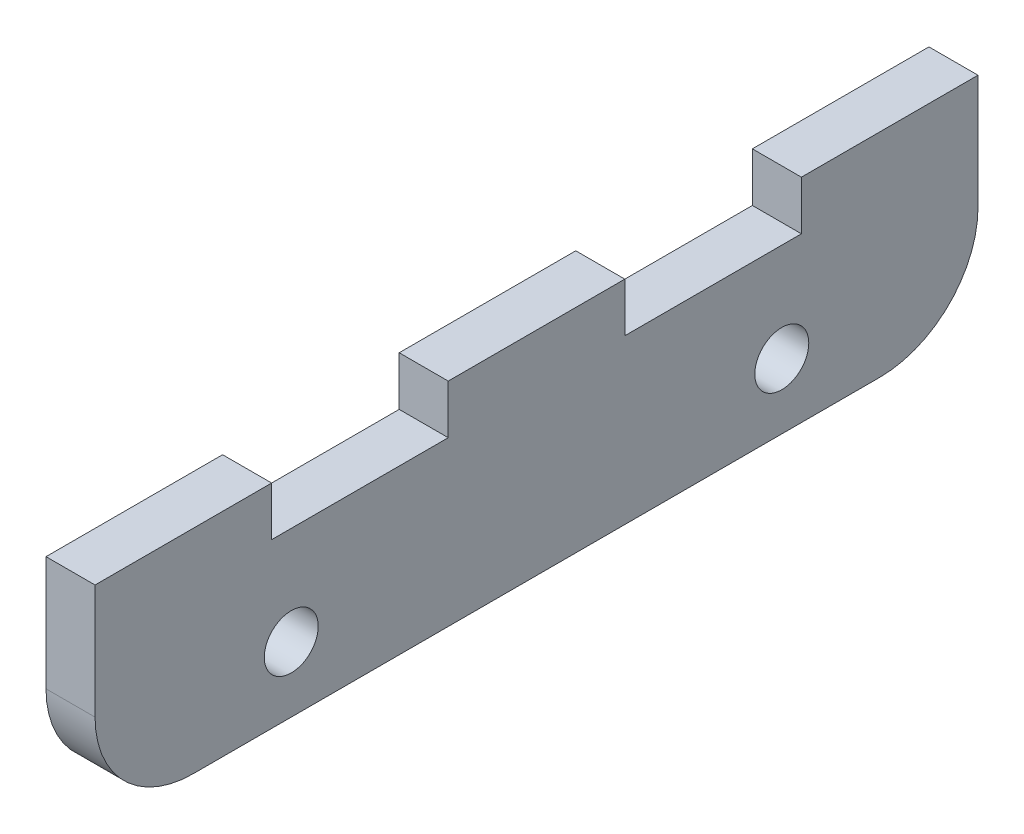
ISO-10303-21;
HEADER;
FILE_DESCRIPTION(('STEP AP214'),'2;1');
FILE_NAME('part.step','',(''),(''),'','','');
FILE_SCHEMA(('AUTOMOTIVE_DESIGN { 1 0 10303 214 1 1 1 1 }'));
ENDSEC;
DATA;
#1=APPLICATION_CONTEXT('core data for automotive mechanical design processes');
#2=APPLICATION_PROTOCOL_DEFINITION('international standard','automotive_design',2000,#1);
#3=PRODUCT_CONTEXT('',#1,'mechanical');
#4=PRODUCT('Part','Part','',(#3));
#5=PRODUCT_RELATED_PRODUCT_CATEGORY('part','',(#4));
#6=PRODUCT_DEFINITION_FORMATION('','',#4);
#7=PRODUCT_DEFINITION_CONTEXT('part definition',#1,'design');
#8=PRODUCT_DEFINITION('design','',#6,#7);
#9=PRODUCT_DEFINITION_SHAPE('','',#8);
#10=(LENGTH_UNIT() NAMED_UNIT(*) SI_UNIT(.MILLI.,.METRE.));
#11=(NAMED_UNIT(*) PLANE_ANGLE_UNIT() SI_UNIT($,.RADIAN.));
#12=(NAMED_UNIT(*) SI_UNIT($,.STERADIAN.) SOLID_ANGLE_UNIT());
#13=UNCERTAINTY_MEASURE_WITH_UNIT(LENGTH_MEASURE(1.E-05),#10,'distance_accuracy_value','');
#14=(GEOMETRIC_REPRESENTATION_CONTEXT(3) GLOBAL_UNCERTAINTY_ASSIGNED_CONTEXT((#13)) GLOBAL_UNIT_ASSIGNED_CONTEXT((#10,
#11,#12)) REPRESENTATION_CONTEXT('',''));
#15=CARTESIAN_POINT('',(0.,0.,0.));
#16=DIRECTION('',(0.,0.,1.));
#17=DIRECTION('',(1.,0.,0.));
#18=AXIS2_PLACEMENT_3D('',#15,#16,#17);
#19=CARTESIAN_POINT('',(3.,-0.499999999999992,-21.));
#20=DIRECTION('',(-1.,0.,0.));
#21=DIRECTION('',(0.,0.,1.));
#22=AXIS2_PLACEMENT_3D('',#19,#20,#21);
#23=PLANE('',#22);
#24=DIRECTION('',(0.,0.,1.));
#25=VECTOR('',#24,1.);
#26=CARTESIAN_POINT('',(3.,6.50000000000001,27.));
#27=LINE('',#26,#25);
#28=CARTESIAN_POINT('',(3.,6.50000000000001,16.2));
#29=VERTEX_POINT('',#28);
#30=CARTESIAN_POINT('',(3.,6.50000000000001,27.));
#31=VERTEX_POINT('',#30);
#32=EDGE_CURVE('E193',#29,#31,#27,.T.);
#33=ORIENTED_EDGE('',*,*,#32,.T.);
#34=DIRECTION('',(0.,-1.,0.));
#35=VECTOR('',#34,1.);
#36=CARTESIAN_POINT('',(3.,-0.499999999999947,27.));
#37=LINE('',#36,#35);
#38=CARTESIAN_POINT('',(3.,-0.499999999999947,27.));
#39=VERTEX_POINT('',#38);
#40=EDGE_CURVE('E111',#31,#39,#37,.T.);
#41=ORIENTED_EDGE('',*,*,#40,.T.);
#42=CARTESIAN_POINT('',(3.,-0.499999999999989,21.));
#43=DIRECTION('',(1.,0.,0.));
#44=DIRECTION('',(0.,0.,1.));
#45=AXIS2_PLACEMENT_3D('',#42,#43,#44);
#46=CIRCLE('',#45,6.);
#47=CARTESIAN_POINT('',(3.,-6.49999999999999,20.9999999999999));
#48=VERTEX_POINT('',#47);
#49=EDGE_CURVE('E226',#39,#48,#46,.T.);
#50=ORIENTED_EDGE('',*,*,#49,.T.);
#51=DIRECTION('',(0.,0.,-1.));
#52=VECTOR('',#51,1.);
#53=CARTESIAN_POINT('',(3.,-6.49999999999999,-21.));
#54=LINE('',#53,#52);
#55=CARTESIAN_POINT('',(3.,-6.49999999999999,-21.));
#56=VERTEX_POINT('',#55);
#57=EDGE_CURVE('E245',#48,#56,#54,.T.);
#58=ORIENTED_EDGE('',*,*,#57,.T.);
#59=CARTESIAN_POINT('',(3.,-0.499999999999992,-21.));
#60=DIRECTION('',(1.,0.,0.));
#61=DIRECTION('',(0.,0.,1.));
#62=AXIS2_PLACEMENT_3D('',#59,#60,#61);
#63=CIRCLE('',#62,6.);
#64=CARTESIAN_POINT('',(3.,-0.499999999999948,-27.));
#65=VERTEX_POINT('',#64);
#66=EDGE_CURVE('E242',#56,#65,#63,.T.);
#67=ORIENTED_EDGE('',*,*,#66,.T.);
#68=DIRECTION('',(0.,1.,0.));
#69=VECTOR('',#68,1.);
#70=CARTESIAN_POINT('',(3.,-0.499999999999949,-27.));
#71=LINE('',#70,#69);
#72=CARTESIAN_POINT('',(3.,6.50000000000001,-27.));
#73=VERTEX_POINT('',#72);
#74=EDGE_CURVE('E244',#65,#73,#71,.T.);
#75=ORIENTED_EDGE('',*,*,#74,.T.);
#76=DIRECTION('',(0.,0.,1.));
#77=VECTOR('',#76,1.);
#78=CARTESIAN_POINT('',(3.,6.50000000000001,-27.));
#79=LINE('',#78,#77);
#80=CARTESIAN_POINT('',(3.,6.50000000000002,-16.2));
#81=VERTEX_POINT('',#80);
#82=EDGE_CURVE('E247',#73,#81,#79,.T.);
#83=ORIENTED_EDGE('',*,*,#82,.T.);
#84=DIRECTION('',(0.,-1.,0.));
#85=VECTOR('',#84,1.);
#86=CARTESIAN_POINT('',(3.,6.50000000000002,-16.2));
#87=LINE('',#86,#85);
#88=CARTESIAN_POINT('',(3.,3.50000000000001,-16.2));
#89=VERTEX_POINT('',#88);
#90=EDGE_CURVE('E253',#81,#89,#87,.T.);
#91=ORIENTED_EDGE('',*,*,#90,.T.);
#92=DIRECTION('',(0.,0.,1.));
#93=VECTOR('',#92,1.);
#94=CARTESIAN_POINT('',(3.,3.50000000000001,-16.2));
#95=LINE('',#94,#93);
#96=CARTESIAN_POINT('',(3.,3.50000000000001,-5.40000000000001));
#97=VERTEX_POINT('',#96);
#98=EDGE_CURVE('E255',#89,#97,#95,.T.);
#99=ORIENTED_EDGE('',*,*,#98,.T.);
#100=DIRECTION('',(0.,1.,0.));
#101=VECTOR('',#100,1.);
#102=CARTESIAN_POINT('',(3.,3.50000000000001,-5.40000000000001));
#103=LINE('',#102,#101);
#104=CARTESIAN_POINT('',(3.,6.50000000000001,-5.40000000000001));
#105=VERTEX_POINT('',#104);
#106=EDGE_CURVE('E257',#97,#105,#103,.T.);
#107=ORIENTED_EDGE('',*,*,#106,.T.);
#108=DIRECTION('',(0.,0.,1.));
#109=VECTOR('',#108,1.);
#110=CARTESIAN_POINT('',(3.,6.50000000000001,-5.40000000000001));
#111=LINE('',#110,#109);
#112=CARTESIAN_POINT('',(3.,6.50000000000001,5.39999999999999));
#113=VERTEX_POINT('',#112);
#114=EDGE_CURVE('E148',#105,#113,#111,.T.);
#115=ORIENTED_EDGE('',*,*,#114,.T.);
#116=DIRECTION('',(0.,-1.,0.));
#117=VECTOR('',#116,1.);
#118=CARTESIAN_POINT('',(3.,3.50000000000001,5.39999999999999));
#119=LINE('',#118,#117);
#120=CARTESIAN_POINT('',(3.,3.50000000000001,5.39999999999999));
#121=VERTEX_POINT('',#120);
#122=EDGE_CURVE('E142',#113,#121,#119,.T.);
#123=ORIENTED_EDGE('',*,*,#122,.T.);
#124=DIRECTION('',(0.,0.,1.));
#125=VECTOR('',#124,1.);
#126=CARTESIAN_POINT('',(3.,3.50000000000001,5.39999999999999));
#127=LINE('',#126,#125);
#128=CARTESIAN_POINT('',(3.,3.50000000000001,16.2));
#129=VERTEX_POINT('',#128);
#130=EDGE_CURVE('E146',#121,#129,#127,.T.);
#131=ORIENTED_EDGE('',*,*,#130,.T.);
#132=DIRECTION('',(0.,1.,0.));
#133=VECTOR('',#132,1.);
#134=CARTESIAN_POINT('',(3.,3.50000000000001,16.2));
#135=LINE('',#134,#133);
#136=EDGE_CURVE('E50',#129,#29,#135,.T.);
#137=ORIENTED_EDGE('',*,*,#136,.T.);
#138=EDGE_LOOP('',(#33,#41,#50,#58,#67,#75,#83,#91,#99,#107,#115,#123,#131,#137));
#139=FACE_BOUND('',#138,.T.);
#140=CARTESIAN_POINT('',(3.,-2.50903230817688,15.));
#141=DIRECTION('',(1.,0.,0.));
#142=DIRECTION('',(0.,0.,-1.));
#143=AXIS2_PLACEMENT_3D('',#140,#141,#142);
#144=CIRCLE('',#143,1.65);
#145=CARTESIAN_POINT('',(3.,-2.50903230817688,13.35));
#146=VERTEX_POINT('',#145);
#147=EDGE_CURVE('E170',#146,#146,#144,.T.);
#148=ORIENTED_EDGE('',*,*,#147,.F.);
#149=EDGE_LOOP('',(#148));
#150=FACE_BOUND('',#149,.T.);
#151=CARTESIAN_POINT('',(3.,-2.50903230817688,-15.));
#152=DIRECTION('',(1.,0.,0.));
#153=DIRECTION('',(0.,0.,-1.));
#154=AXIS2_PLACEMENT_3D('',#151,#152,#153);
#155=CIRCLE('',#154,1.65);
#156=CARTESIAN_POINT('',(3.,-2.50903230817688,-16.65));
#157=VERTEX_POINT('',#156);
#158=EDGE_CURVE('E298',#157,#157,#155,.T.);
#159=ORIENTED_EDGE('',*,*,#158,.F.);
#160=EDGE_LOOP('',(#159));
#161=FACE_BOUND('',#160,.T.);
#162=ADVANCED_FACE('F33',(#139,#150,#161),#23,.F.);
#163=CARTESIAN_POINT('',(0.,-0.499999999999992,-21.));
#164=DIRECTION('',(-1.,0.,0.));
#165=DIRECTION('',(0.,0.,1.));
#166=AXIS2_PLACEMENT_3D('',#163,#164,#165);
#167=PLANE('',#166);
#168=CARTESIAN_POINT('',(0.,-2.50903230817688,15.));
#169=DIRECTION('',(1.,0.,0.));
#170=DIRECTION('',(0.,0.,-1.));
#171=AXIS2_PLACEMENT_3D('',#168,#169,#170);
#172=CIRCLE('',#171,1.65);
#173=CARTESIAN_POINT('',(0.,-2.50903230817688,13.35));
#174=VERTEX_POINT('',#173);
#175=EDGE_CURVE('E303',#174,#174,#172,.T.);
#176=ORIENTED_EDGE('',*,*,#175,.T.);
#177=EDGE_LOOP('',(#176));
#178=FACE_BOUND('',#177,.T.);
#179=DIRECTION('',(0.,0.,1.));
#180=VECTOR('',#179,1.);
#181=CARTESIAN_POINT('',(0.,6.50000000000001,27.));
#182=LINE('',#181,#180);
#183=CARTESIAN_POINT('',(0.,6.50000000000001,16.2));
#184=VERTEX_POINT('',#183);
#185=CARTESIAN_POINT('',(0.,6.50000000000001,27.));
#186=VERTEX_POINT('',#185);
#187=EDGE_CURVE('E166',#184,#186,#182,.T.);
#188=ORIENTED_EDGE('',*,*,#187,.F.);
#189=DIRECTION('',(0.,1.,0.));
#190=VECTOR('',#189,1.);
#191=CARTESIAN_POINT('',(0.,3.50000000000001,16.2));
#192=LINE('',#191,#190);
#193=CARTESIAN_POINT('',(0.,3.50000000000001,16.2));
#194=VERTEX_POINT('',#193);
#195=EDGE_CURVE('E103',#194,#184,#192,.T.);
#196=ORIENTED_EDGE('',*,*,#195,.F.);
#197=DIRECTION('',(0.,0.,1.));
#198=VECTOR('',#197,1.);
#199=CARTESIAN_POINT('',(0.,3.50000000000001,5.39999999999999));
#200=LINE('',#199,#198);
#201=CARTESIAN_POINT('',(0.,3.50000000000001,5.39999999999999));
#202=VERTEX_POINT('',#201);
#203=EDGE_CURVE('E97',#202,#194,#200,.T.);
#204=ORIENTED_EDGE('',*,*,#203,.F.);
#205=DIRECTION('',(0.,-1.,0.));
#206=VECTOR('',#205,1.);
#207=CARTESIAN_POINT('',(0.,3.50000000000001,5.39999999999999));
#208=LINE('',#207,#206);
#209=CARTESIAN_POINT('',(0.,6.50000000000001,5.39999999999999));
#210=VERTEX_POINT('',#209);
#211=EDGE_CURVE('E156',#210,#202,#208,.T.);
#212=ORIENTED_EDGE('',*,*,#211,.F.);
#213=DIRECTION('',(0.,0.,1.));
#214=VECTOR('',#213,1.);
#215=CARTESIAN_POINT('',(0.,6.50000000000001,-5.40000000000001));
#216=LINE('',#215,#214);
#217=CARTESIAN_POINT('',(0.,6.50000000000001,-5.40000000000001));
#218=VERTEX_POINT('',#217);
#219=EDGE_CURVE('E188',#218,#210,#216,.T.);
#220=ORIENTED_EDGE('',*,*,#219,.F.);
#221=DIRECTION('',(0.,1.,0.));
#222=VECTOR('',#221,1.);
#223=CARTESIAN_POINT('',(0.,3.50000000000001,-5.40000000000001));
#224=LINE('',#223,#222);
#225=CARTESIAN_POINT('',(0.,3.50000000000001,-5.40000000000001));
#226=VERTEX_POINT('',#225);
#227=EDGE_CURVE('E186',#226,#218,#224,.T.);
#228=ORIENTED_EDGE('',*,*,#227,.F.);
#229=DIRECTION('',(0.,0.,1.));
#230=VECTOR('',#229,1.);
#231=CARTESIAN_POINT('',(0.,3.50000000000001,-16.2));
#232=LINE('',#231,#230);
#233=CARTESIAN_POINT('',(0.,3.50000000000001,-16.2));
#234=VERTEX_POINT('',#233);
#235=EDGE_CURVE('E184',#234,#226,#232,.T.);
#236=ORIENTED_EDGE('',*,*,#235,.F.);
#237=DIRECTION('',(0.,-1.,0.));
#238=VECTOR('',#237,1.);
#239=CARTESIAN_POINT('',(0.,6.50000000000002,-16.2));
#240=LINE('',#239,#238);
#241=CARTESIAN_POINT('',(0.,6.50000000000002,-16.2));
#242=VERTEX_POINT('',#241);
#243=EDGE_CURVE('E182',#242,#234,#240,.T.);
#244=ORIENTED_EDGE('',*,*,#243,.F.);
#245=DIRECTION('',(0.,0.,1.));
#246=VECTOR('',#245,1.);
#247=CARTESIAN_POINT('',(0.,6.50000000000001,-27.));
#248=LINE('',#247,#246);
#249=CARTESIAN_POINT('',(0.,6.50000000000001,-27.));
#250=VERTEX_POINT('',#249);
#251=EDGE_CURVE('E180',#250,#242,#248,.T.);
#252=ORIENTED_EDGE('',*,*,#251,.F.);
#253=DIRECTION('',(0.,1.,0.));
#254=VECTOR('',#253,1.);
#255=CARTESIAN_POINT('',(0.,-0.499999999999949,-27.));
#256=LINE('',#255,#254);
#257=CARTESIAN_POINT('',(0.,-0.499999999999948,-27.));
#258=VERTEX_POINT('',#257);
#259=EDGE_CURVE('E178',#258,#250,#256,.T.);
#260=ORIENTED_EDGE('',*,*,#259,.F.);
#261=CARTESIAN_POINT('',(0.,-0.499999999999992,-21.));
#262=DIRECTION('',(1.,0.,0.));
#263=DIRECTION('',(0.,0.,1.));
#264=AXIS2_PLACEMENT_3D('',#261,#262,#263);
#265=CIRCLE('',#264,6.);
#266=CARTESIAN_POINT('',(0.,-6.49999999999999,-21.));
#267=VERTEX_POINT('',#266);
#268=EDGE_CURVE('E176',#267,#258,#265,.T.);
#269=ORIENTED_EDGE('',*,*,#268,.F.);
#270=DIRECTION('',(0.,0.,-1.));
#271=VECTOR('',#270,1.);
#272=CARTESIAN_POINT('',(0.,-6.49999999999999,-21.));
#273=LINE('',#272,#271);
#274=CARTESIAN_POINT('',(0.,-6.49999999999999,20.9999999999999));
#275=VERTEX_POINT('',#274);
#276=EDGE_CURVE('E174',#275,#267,#273,.T.);
#277=ORIENTED_EDGE('',*,*,#276,.F.);
#278=CARTESIAN_POINT('',(0.,-0.499999999999989,21.));
#279=DIRECTION('',(1.,0.,0.));
#280=DIRECTION('',(0.,0.,1.));
#281=AXIS2_PLACEMENT_3D('',#278,#279,#280);
#282=CIRCLE('',#281,6.);
#283=CARTESIAN_POINT('',(0.,-0.499999999999947,27.));
#284=VERTEX_POINT('',#283);
#285=EDGE_CURVE('E172',#284,#275,#282,.T.);
#286=ORIENTED_EDGE('',*,*,#285,.F.);
#287=DIRECTION('',(0.,-1.,0.));
#288=VECTOR('',#287,1.);
#289=CARTESIAN_POINT('',(0.,-0.499999999999947,27.));
#290=LINE('',#289,#288);
#291=EDGE_CURVE('E169',#186,#284,#290,.T.);
#292=ORIENTED_EDGE('',*,*,#291,.F.);
#293=EDGE_LOOP('',(#188,#196,#204,#212,#220,#228,#236,#244,#252,#260,#269,#277,#286,#292));
#294=FACE_BOUND('',#293,.T.);
#295=CARTESIAN_POINT('',(0.,-2.50903230817688,-15.));
#296=DIRECTION('',(1.,0.,0.));
#297=DIRECTION('',(0.,0.,-1.));
#298=AXIS2_PLACEMENT_3D('',#295,#296,#297);
#299=CIRCLE('',#298,1.65);
#300=CARTESIAN_POINT('',(0.,-2.50903230817688,-16.65));
#301=VERTEX_POINT('',#300);
#302=EDGE_CURVE('E301',#301,#301,#299,.T.);
#303=ORIENTED_EDGE('',*,*,#302,.T.);
#304=EDGE_LOOP('',(#303));
#305=FACE_BOUND('',#304,.T.);
#306=ADVANCED_FACE('F230',(#178,#294,#305),#167,.T.);
#307=CARTESIAN_POINT('',(3.,6.50000000000001,27.));
#308=DIRECTION('',(0.,-1.,0.));
#309=DIRECTION('',(0.,0.,-1.));
#310=AXIS2_PLACEMENT_3D('',#307,#308,#309);
#311=PLANE('',#310);
#312=ORIENTED_EDGE('',*,*,#187,.T.);
#313=DIRECTION('',(-1.,0.,0.));
#314=VECTOR('',#313,1.);
#315=CARTESIAN_POINT('',(3.,6.50000000000001,27.));
#316=LINE('',#315,#314);
#317=EDGE_CURVE('E11',#31,#186,#316,.T.);
#318=ORIENTED_EDGE('',*,*,#317,.F.);
#319=ORIENTED_EDGE('',*,*,#32,.F.);
#320=DIRECTION('',(-1.,0.,0.));
#321=VECTOR('',#320,1.);
#322=CARTESIAN_POINT('',(3.,6.50000000000001,16.2));
#323=LINE('',#322,#321);
#324=EDGE_CURVE('E162',#29,#184,#323,.T.);
#325=ORIENTED_EDGE('',*,*,#324,.T.);
#326=EDGE_LOOP('',(#312,#318,#319,#325));
#327=FACE_BOUND('',#326,.T.);
#328=ADVANCED_FACE('F35',(#327),#311,.F.);
#329=CARTESIAN_POINT('',(3.,-0.499999999999947,27.));
#330=DIRECTION('',(0.,0.,-1.));
#331=DIRECTION('',(-1.,0.,0.));
#332=AXIS2_PLACEMENT_3D('',#329,#330,#331);
#333=PLANE('',#332);
#334=ORIENTED_EDGE('',*,*,#291,.T.);
#335=DIRECTION('',(-1.,0.,0.));
#336=VECTOR('',#335,1.);
#337=CARTESIAN_POINT('',(3.,-0.499999999999947,27.));
#338=LINE('',#337,#336);
#339=EDGE_CURVE('E42',#39,#284,#338,.T.);
#340=ORIENTED_EDGE('',*,*,#339,.F.);
#341=ORIENTED_EDGE('',*,*,#40,.F.);
#342=ORIENTED_EDGE('',*,*,#317,.T.);
#343=EDGE_LOOP('',(#334,#340,#341,#342));
#344=FACE_BOUND('',#343,.T.);
#345=ADVANCED_FACE('F418',(#344),#333,.F.);
#346=CARTESIAN_POINT('',(3.,-0.499999999999989,21.));
#347=DIRECTION('',(-1.,0.,0.));
#348=DIRECTION('',(0.,0.,1.));
#349=AXIS2_PLACEMENT_3D('',#346,#347,#348);
#350=CYLINDRICAL_SURFACE('',#349,6.);
#351=ORIENTED_EDGE('',*,*,#285,.T.);
#352=DIRECTION('',(-1.,0.,0.));
#353=VECTOR('',#352,1.);
#354=CARTESIAN_POINT('',(3.,-6.49999999999999,20.9999999999999));
#355=LINE('',#354,#353);
#356=EDGE_CURVE('E218',#48,#275,#355,.T.);
#357=ORIENTED_EDGE('',*,*,#356,.F.);
#358=ORIENTED_EDGE('',*,*,#49,.F.);
#359=ORIENTED_EDGE('',*,*,#339,.T.);
#360=EDGE_LOOP('',(#351,#357,#358,#359));
#361=FACE_BOUND('',#360,.T.);
#362=ADVANCED_FACE('F224',(#361),#350,.T.);
#363=CARTESIAN_POINT('',(3.,-6.49999999999999,-21.));
#364=DIRECTION('',(0.,1.,0.));
#365=DIRECTION('',(0.,0.,1.));
#366=AXIS2_PLACEMENT_3D('',#363,#364,#365);
#367=PLANE('',#366);
#368=ORIENTED_EDGE('',*,*,#276,.T.);
#369=DIRECTION('',(-1.,0.,0.));
#370=VECTOR('',#369,1.);
#371=CARTESIAN_POINT('',(3.,-6.49999999999999,-21.));
#372=LINE('',#371,#370);
#373=EDGE_CURVE('E215',#56,#267,#372,.T.);
#374=ORIENTED_EDGE('',*,*,#373,.F.);
#375=ORIENTED_EDGE('',*,*,#57,.F.);
#376=ORIENTED_EDGE('',*,*,#356,.T.);
#377=EDGE_LOOP('',(#368,#374,#375,#376));
#378=FACE_BOUND('',#377,.T.);
#379=ADVANCED_FACE('F236',(#378),#367,.F.);
#380=CARTESIAN_POINT('',(3.,-0.499999999999992,-21.));
#381=DIRECTION('',(-1.,0.,0.));
#382=DIRECTION('',(0.,0.,1.));
#383=AXIS2_PLACEMENT_3D('',#380,#381,#382);
#384=CYLINDRICAL_SURFACE('',#383,6.);
#385=ORIENTED_EDGE('',*,*,#268,.T.);
#386=DIRECTION('',(-1.,0.,0.));
#387=VECTOR('',#386,1.);
#388=CARTESIAN_POINT('',(3.,-0.499999999999948,-27.));
#389=LINE('',#388,#387);
#390=EDGE_CURVE('E212',#65,#258,#389,.T.);
#391=ORIENTED_EDGE('',*,*,#390,.F.);
#392=ORIENTED_EDGE('',*,*,#66,.F.);
#393=ORIENTED_EDGE('',*,*,#373,.T.);
#394=EDGE_LOOP('',(#385,#391,#392,#393));
#395=FACE_BOUND('',#394,.T.);
#396=ADVANCED_FACE('F240',(#395),#384,.T.);
#397=CARTESIAN_POINT('',(3.,-0.499999999999949,-27.));
#398=DIRECTION('',(0.,0.,1.));
#399=DIRECTION('',(1.,0.,0.));
#400=AXIS2_PLACEMENT_3D('',#397,#398,#399);
#401=PLANE('',#400);
#402=ORIENTED_EDGE('',*,*,#259,.T.);
#403=DIRECTION('',(-1.,0.,0.));
#404=VECTOR('',#403,1.);
#405=CARTESIAN_POINT('',(3.,6.50000000000001,-27.));
#406=LINE('',#405,#404);
#407=EDGE_CURVE('E209',#73,#250,#406,.T.);
#408=ORIENTED_EDGE('',*,*,#407,.F.);
#409=ORIENTED_EDGE('',*,*,#74,.F.);
#410=ORIENTED_EDGE('',*,*,#390,.T.);
#411=EDGE_LOOP('',(#402,#408,#409,#410));
#412=FACE_BOUND('',#411,.T.);
#413=ADVANCED_FACE('F383',(#412),#401,.F.);
#414=CARTESIAN_POINT('',(3.,6.50000000000001,-27.));
#415=DIRECTION('',(0.,-1.,0.));
#416=DIRECTION('',(0.,0.,-1.));
#417=AXIS2_PLACEMENT_3D('',#414,#415,#416);
#418=PLANE('',#417);
#419=ORIENTED_EDGE('',*,*,#251,.T.);
#420=DIRECTION('',(-1.,0.,0.));
#421=VECTOR('',#420,1.);
#422=CARTESIAN_POINT('',(3.,6.50000000000002,-16.2));
#423=LINE('',#422,#421);
#424=EDGE_CURVE('E206',#81,#242,#423,.T.);
#425=ORIENTED_EDGE('',*,*,#424,.F.);
#426=ORIENTED_EDGE('',*,*,#82,.F.);
#427=ORIENTED_EDGE('',*,*,#407,.T.);
#428=EDGE_LOOP('',(#419,#425,#426,#427));
#429=FACE_BOUND('',#428,.T.);
#430=ADVANCED_FACE('F373',(#429),#418,.F.);
#431=CARTESIAN_POINT('',(3.,6.50000000000002,-16.2));
#432=DIRECTION('',(0.,0.,-1.));
#433=DIRECTION('',(-1.,0.,0.));
#434=AXIS2_PLACEMENT_3D('',#431,#432,#433);
#435=PLANE('',#434);
#436=ORIENTED_EDGE('',*,*,#243,.T.);
#437=DIRECTION('',(-1.,0.,0.));
#438=VECTOR('',#437,1.);
#439=CARTESIAN_POINT('',(3.,3.50000000000001,-16.2));
#440=LINE('',#439,#438);
#441=EDGE_CURVE('E203',#89,#234,#440,.T.);
#442=ORIENTED_EDGE('',*,*,#441,.F.);
#443=ORIENTED_EDGE('',*,*,#90,.F.);
#444=ORIENTED_EDGE('',*,*,#424,.T.);
#445=EDGE_LOOP('',(#436,#442,#443,#444));
#446=FACE_BOUND('',#445,.T.);
#447=ADVANCED_FACE('F363',(#446),#435,.F.);
#448=CARTESIAN_POINT('',(3.,3.50000000000001,-16.2));
#449=DIRECTION('',(0.,-1.,0.));
#450=DIRECTION('',(0.,0.,-1.));
#451=AXIS2_PLACEMENT_3D('',#448,#449,#450);
#452=PLANE('',#451);
#453=ORIENTED_EDGE('',*,*,#235,.T.);
#454=DIRECTION('',(-1.,0.,0.));
#455=VECTOR('',#454,1.);
#456=CARTESIAN_POINT('',(3.,3.50000000000001,-5.40000000000001));
#457=LINE('',#456,#455);
#458=EDGE_CURVE('E200',#97,#226,#457,.T.);
#459=ORIENTED_EDGE('',*,*,#458,.F.);
#460=ORIENTED_EDGE('',*,*,#98,.F.);
#461=ORIENTED_EDGE('',*,*,#441,.T.);
#462=EDGE_LOOP('',(#453,#459,#460,#461));
#463=FACE_BOUND('',#462,.T.);
#464=ADVANCED_FACE('F354',(#463),#452,.F.);
#465=CARTESIAN_POINT('',(3.,3.50000000000001,-5.40000000000001));
#466=DIRECTION('',(0.,0.,1.));
#467=DIRECTION('',(1.,0.,0.));
#468=AXIS2_PLACEMENT_3D('',#465,#466,#467);
#469=PLANE('',#468);
#470=ORIENTED_EDGE('',*,*,#227,.T.);
#471=DIRECTION('',(-1.,0.,0.));
#472=VECTOR('',#471,1.);
#473=CARTESIAN_POINT('',(3.,6.50000000000001,-5.40000000000001));
#474=LINE('',#473,#472);
#475=EDGE_CURVE('E197',#105,#218,#474,.T.);
#476=ORIENTED_EDGE('',*,*,#475,.F.);
#477=ORIENTED_EDGE('',*,*,#106,.F.);
#478=ORIENTED_EDGE('',*,*,#458,.T.);
#479=EDGE_LOOP('',(#470,#476,#477,#478));
#480=FACE_BOUND('',#479,.T.);
#481=ADVANCED_FACE('F263',(#480),#469,.F.);
#482=CARTESIAN_POINT('',(3.,6.50000000000001,-5.40000000000001));
#483=DIRECTION('',(0.,-1.,0.));
#484=DIRECTION('',(0.,0.,-1.));
#485=AXIS2_PLACEMENT_3D('',#482,#483,#484);
#486=PLANE('',#485);
#487=ORIENTED_EDGE('',*,*,#219,.T.);
#488=DIRECTION('',(-1.,0.,0.));
#489=VECTOR('',#488,1.);
#490=CARTESIAN_POINT('',(3.,6.50000000000001,5.39999999999999));
#491=LINE('',#490,#489);
#492=EDGE_CURVE('E157',#113,#210,#491,.T.);
#493=ORIENTED_EDGE('',*,*,#492,.F.);
#494=ORIENTED_EDGE('',*,*,#114,.F.);
#495=ORIENTED_EDGE('',*,*,#475,.T.);
#496=EDGE_LOOP('',(#487,#493,#494,#495));
#497=FACE_BOUND('',#496,.T.);
#498=ADVANCED_FACE('F267',(#497),#486,.F.);
#499=CARTESIAN_POINT('',(3.,3.50000000000001,5.39999999999999));
#500=DIRECTION('',(0.,0.,-1.));
#501=DIRECTION('',(-1.,0.,0.));
#502=AXIS2_PLACEMENT_3D('',#499,#500,#501);
#503=PLANE('',#502);
#504=ORIENTED_EDGE('',*,*,#211,.T.);
#505=DIRECTION('',(-1.,0.,0.));
#506=VECTOR('',#505,1.);
#507=CARTESIAN_POINT('',(3.,3.50000000000001,5.39999999999999));
#508=LINE('',#507,#506);
#509=EDGE_CURVE('E153',#121,#202,#508,.T.);
#510=ORIENTED_EDGE('',*,*,#509,.F.);
#511=ORIENTED_EDGE('',*,*,#122,.F.);
#512=ORIENTED_EDGE('',*,*,#492,.T.);
#513=EDGE_LOOP('',(#504,#510,#511,#512));
#514=FACE_BOUND('',#513,.T.);
#515=ADVANCED_FACE('F154',(#514),#503,.F.);
#516=CARTESIAN_POINT('',(3.,3.50000000000001,5.39999999999999));
#517=DIRECTION('',(0.,-1.,0.));
#518=DIRECTION('',(0.,0.,-1.));
#519=AXIS2_PLACEMENT_3D('',#516,#517,#518);
#520=PLANE('',#519);
#521=ORIENTED_EDGE('',*,*,#203,.T.);
#522=DIRECTION('',(-1.,0.,0.));
#523=VECTOR('',#522,1.);
#524=CARTESIAN_POINT('',(3.,3.50000000000001,16.2));
#525=LINE('',#524,#523);
#526=EDGE_CURVE('E158',#129,#194,#525,.T.);
#527=ORIENTED_EDGE('',*,*,#526,.F.);
#528=ORIENTED_EDGE('',*,*,#130,.F.);
#529=ORIENTED_EDGE('',*,*,#509,.T.);
#530=EDGE_LOOP('',(#521,#527,#528,#529));
#531=FACE_BOUND('',#530,.T.);
#532=ADVANCED_FACE('F160',(#531),#520,.F.);
#533=CARTESIAN_POINT('',(3.,3.50000000000001,16.2));
#534=DIRECTION('',(0.,0.,1.));
#535=DIRECTION('',(1.,0.,0.));
#536=AXIS2_PLACEMENT_3D('',#533,#534,#535);
#537=PLANE('',#536);
#538=ORIENTED_EDGE('',*,*,#195,.T.);
#539=ORIENTED_EDGE('',*,*,#324,.F.);
#540=ORIENTED_EDGE('',*,*,#136,.F.);
#541=ORIENTED_EDGE('',*,*,#526,.T.);
#542=EDGE_LOOP('',(#538,#539,#540,#541));
#543=FACE_BOUND('',#542,.T.);
#544=ADVANCED_FACE('F271',(#543),#537,.F.);
#545=CARTESIAN_POINT('',(3.,-2.50903230817688,15.));
#546=DIRECTION('',(-1.,0.,0.));
#547=DIRECTION('',(0.,0.,1.));
#548=AXIS2_PLACEMENT_3D('',#545,#546,#547);
#549=CYLINDRICAL_SURFACE('',#548,1.65);
#550=ORIENTED_EDGE('',*,*,#147,.T.);
#551=EDGE_LOOP('',(#550));
#552=FACE_BOUND('',#551,.T.);
#553=ORIENTED_EDGE('',*,*,#175,.F.);
#554=EDGE_LOOP('',(#553));
#555=FACE_BOUND('',#554,.T.);
#556=ADVANCED_FACE('F273',(#552,#555),#549,.F.);
#557=CARTESIAN_POINT('',(3.,-2.50903230817688,-15.));
#558=DIRECTION('',(-1.,0.,0.));
#559=DIRECTION('',(0.,0.,1.));
#560=AXIS2_PLACEMENT_3D('',#557,#558,#559);
#561=CYLINDRICAL_SURFACE('',#560,1.65);
#562=ORIENTED_EDGE('',*,*,#158,.T.);
#563=EDGE_LOOP('',(#562));
#564=FACE_BOUND('',#563,.T.);
#565=ORIENTED_EDGE('',*,*,#302,.F.);
#566=EDGE_LOOP('',(#565));
#567=FACE_BOUND('',#566,.T.);
#568=ADVANCED_FACE('F279',(#564,#567),#561,.F.);
#569=CLOSED_SHELL('',(#162,#306,#328,#345,#362,#379,#396,#413,#430,#447,#464,#481,#498,#515,
#532,#544,#556,#568));
#570=MANIFOLD_SOLID_BREP('B2',#569);
#571=ADVANCED_BREP_SHAPE_REPRESENTATION('',(#18,#570),#14);
#572=SHAPE_DEFINITION_REPRESENTATION(#9,#571);
ENDSEC;
END-ISO-10303-21;
